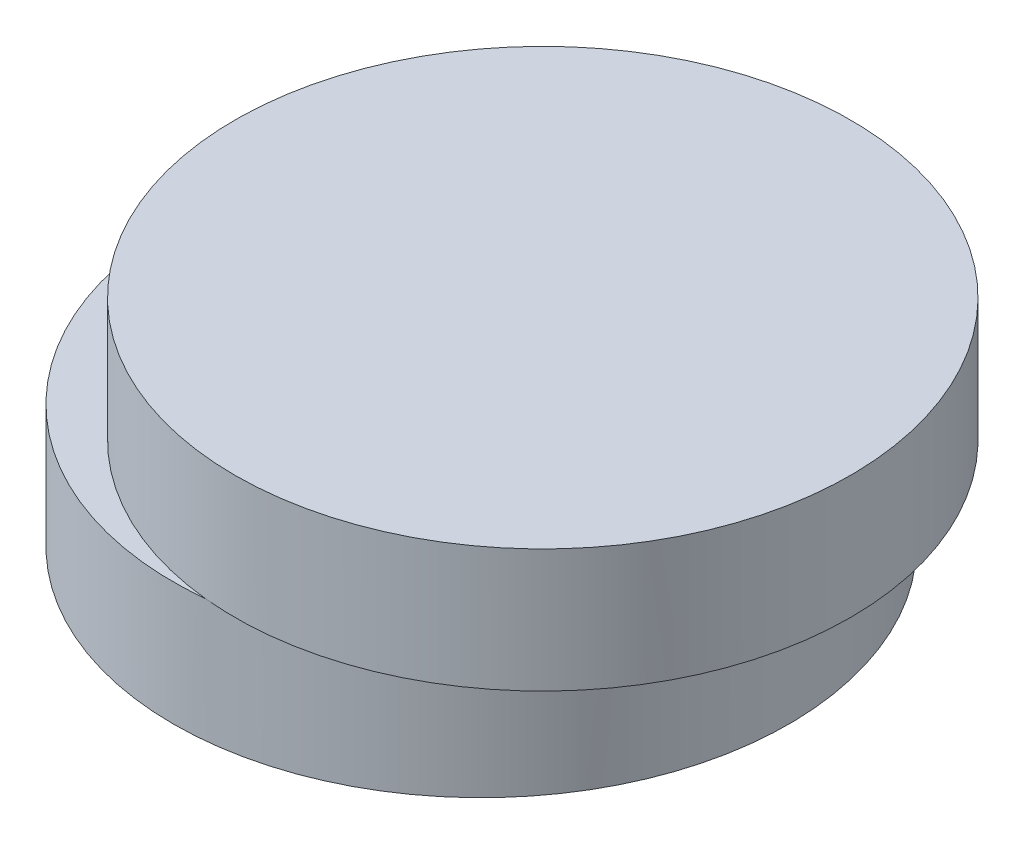
ISO-10303-21;
HEADER;
FILE_DESCRIPTION(('STEP AP214'),'2;1');
FILE_NAME('part.step','',(''),(''),'','','');
FILE_SCHEMA(('AUTOMOTIVE_DESIGN { 1 0 10303 214 1 1 1 1 }'));
ENDSEC;
DATA;
#1=APPLICATION_CONTEXT('core data for automotive mechanical design processes');
#2=APPLICATION_PROTOCOL_DEFINITION('international standard','automotive_design',2000,#1);
#3=PRODUCT_CONTEXT('',#1,'mechanical');
#4=PRODUCT('Part','Part','',(#3));
#5=PRODUCT_RELATED_PRODUCT_CATEGORY('part','',(#4));
#6=PRODUCT_DEFINITION_FORMATION('','',#4);
#7=PRODUCT_DEFINITION_CONTEXT('part definition',#1,'design');
#8=PRODUCT_DEFINITION('design','',#6,#7);
#9=PRODUCT_DEFINITION_SHAPE('','',#8);
#10=(LENGTH_UNIT() NAMED_UNIT(*) SI_UNIT(.MILLI.,.METRE.));
#11=(NAMED_UNIT(*) PLANE_ANGLE_UNIT() SI_UNIT($,.RADIAN.));
#12=(NAMED_UNIT(*) SI_UNIT($,.STERADIAN.) SOLID_ANGLE_UNIT());
#13=UNCERTAINTY_MEASURE_WITH_UNIT(LENGTH_MEASURE(1.E-05),#10,'distance_accuracy_value','');
#14=(GEOMETRIC_REPRESENTATION_CONTEXT(3) GLOBAL_UNCERTAINTY_ASSIGNED_CONTEXT((#13)) GLOBAL_UNIT_ASSIGNED_CONTEXT((#10,
#11,#12)) REPRESENTATION_CONTEXT('',''));
#15=CARTESIAN_POINT('',(0.,0.,0.));
#16=DIRECTION('',(0.,0.,1.));
#17=DIRECTION('',(1.,0.,0.));
#18=AXIS2_PLACEMENT_3D('',#15,#16,#17);
#19=CARTESIAN_POINT('',(0.,2.,0.));
#20=DIRECTION('',(0.,-1.,0.));
#21=DIRECTION('',(0.,0.,-1.));
#22=AXIS2_PLACEMENT_3D('',#19,#20,#21);
#23=CYLINDRICAL_SURFACE('',#22,5.);
#24=CARTESIAN_POINT('',(0.,2.,0.));
#25=DIRECTION('',(0.,1.,0.));
#26=DIRECTION('',(0.,0.,1.));
#27=AXIS2_PLACEMENT_3D('',#24,#25,#26);
#28=CIRCLE('',#27,5.);
#29=CARTESIAN_POINT('',(0.500000000000004,2.,4.9749371855331));
#30=VERTEX_POINT('',#29);
#31=CARTESIAN_POINT('',(0.500000000000004,2.,-4.9749371855331));
#32=VERTEX_POINT('',#31);
#33=EDGE_CURVE('E11',#30,#32,#28,.T.);
#34=ORIENTED_EDGE('',*,*,#33,.F.);
#35=EDGE_CURVE('E47',#32,#30,#28,.T.);
#36=ORIENTED_EDGE('',*,*,#35,.F.);
#37=EDGE_LOOP('',(#34,#36));
#38=FACE_BOUND('',#37,.T.);
#39=CARTESIAN_POINT('',(0.,0.,0.));
#40=DIRECTION('',(0.,1.,0.));
#41=DIRECTION('',(0.,0.,1.));
#42=AXIS2_PLACEMENT_3D('',#39,#40,#41);
#43=CIRCLE('',#42,5.);
#44=CARTESIAN_POINT('',(0.,0.,5.));
#45=VERTEX_POINT('',#44);
#46=EDGE_CURVE('E42',#45,#45,#43,.T.);
#47=ORIENTED_EDGE('',*,*,#46,.T.);
#48=EDGE_LOOP('',(#47));
#49=FACE_BOUND('',#48,.T.);
#50=ADVANCED_FACE('F39',(#38,#49),#23,.T.);
#51=CARTESIAN_POINT('',(0.,2.,0.));
#52=DIRECTION('',(0.,1.,0.));
#53=DIRECTION('',(0.,0.,1.));
#54=AXIS2_PLACEMENT_3D('',#51,#52,#53);
#55=PLANE('',#54);
#56=CARTESIAN_POINT('',(1.,2.,0.));
#57=DIRECTION('',(0.,1.,0.));
#58=DIRECTION('',(0.,0.,1.));
#59=AXIS2_PLACEMENT_3D('',#56,#57,#58);
#60=CIRCLE('',#59,5.);
#61=EDGE_CURVE('E53',#32,#30,#60,.T.);
#62=ORIENTED_EDGE('',*,*,#61,.F.);
#63=ORIENTED_EDGE('',*,*,#35,.T.);
#64=EDGE_LOOP('',(#62,#63));
#65=FACE_BOUND('',#64,.T.);
#66=ADVANCED_FACE('F61',(#65),#55,.T.);
#67=CARTESIAN_POINT('',(0.,0.,0.));
#68=DIRECTION('',(0.,1.,0.));
#69=DIRECTION('',(0.,0.,1.));
#70=AXIS2_PLACEMENT_3D('',#67,#68,#69);
#71=PLANE('',#70);
#72=ORIENTED_EDGE('',*,*,#46,.F.);
#73=EDGE_LOOP('',(#72));
#74=FACE_BOUND('',#73,.T.);
#75=ADVANCED_FACE('F75',(#74),#71,.F.);
#76=CARTESIAN_POINT('',(1.,2.,0.));
#77=DIRECTION('',(0.,1.,0.));
#78=DIRECTION('',(0.,0.,1.));
#79=AXIS2_PLACEMENT_3D('',#76,#77,#78);
#80=PLANE('',#79);
#81=EDGE_CURVE('E62',#30,#32,#60,.T.);
#82=ORIENTED_EDGE('',*,*,#81,.F.);
#83=ORIENTED_EDGE('',*,*,#33,.T.);
#84=EDGE_LOOP('',(#82,#83));
#85=FACE_BOUND('',#84,.T.);
#86=ADVANCED_FACE('F63',(#85),#80,.F.);
#87=CARTESIAN_POINT('',(1.,4.,0.));
#88=DIRECTION('',(0.,-1.,0.));
#89=DIRECTION('',(0.,0.,-1.));
#90=AXIS2_PLACEMENT_3D('',#87,#88,#89);
#91=CYLINDRICAL_SURFACE('',#90,5.);
#92=CARTESIAN_POINT('',(1.,4.,0.));
#93=DIRECTION('',(0.,1.,0.));
#94=DIRECTION('',(0.,0.,1.));
#95=AXIS2_PLACEMENT_3D('',#92,#93,#94);
#96=CIRCLE('',#95,5.);
#97=CARTESIAN_POINT('',(1.,4.,5.));
#98=VERTEX_POINT('',#97);
#99=EDGE_CURVE('E67',#98,#98,#96,.T.);
#100=ORIENTED_EDGE('',*,*,#99,.F.);
#101=EDGE_LOOP('',(#100));
#102=FACE_BOUND('',#101,.T.);
#103=ORIENTED_EDGE('',*,*,#61,.T.);
#104=ORIENTED_EDGE('',*,*,#81,.T.);
#105=EDGE_LOOP('',(#103,#104));
#106=FACE_BOUND('',#105,.T.);
#107=ADVANCED_FACE('F66',(#102,#106),#91,.T.);
#108=CARTESIAN_POINT('',(1.,4.,0.));
#109=DIRECTION('',(0.,1.,0.));
#110=DIRECTION('',(0.,0.,1.));
#111=AXIS2_PLACEMENT_3D('',#108,#109,#110);
#112=PLANE('',#111);
#113=ORIENTED_EDGE('',*,*,#99,.T.);
#114=EDGE_LOOP('',(#113));
#115=FACE_BOUND('',#114,.T.);
#116=ADVANCED_FACE('F109',(#115),#112,.T.);
#117=CLOSED_SHELL('',(#50,#66,#75,#86,#107,#116));
#118=MANIFOLD_SOLID_BREP('B2',#117);
#119=ADVANCED_BREP_SHAPE_REPRESENTATION('',(#18,#118),#14);
#120=SHAPE_DEFINITION_REPRESENTATION(#9,#119);
ENDSEC;
END-ISO-10303-21;
